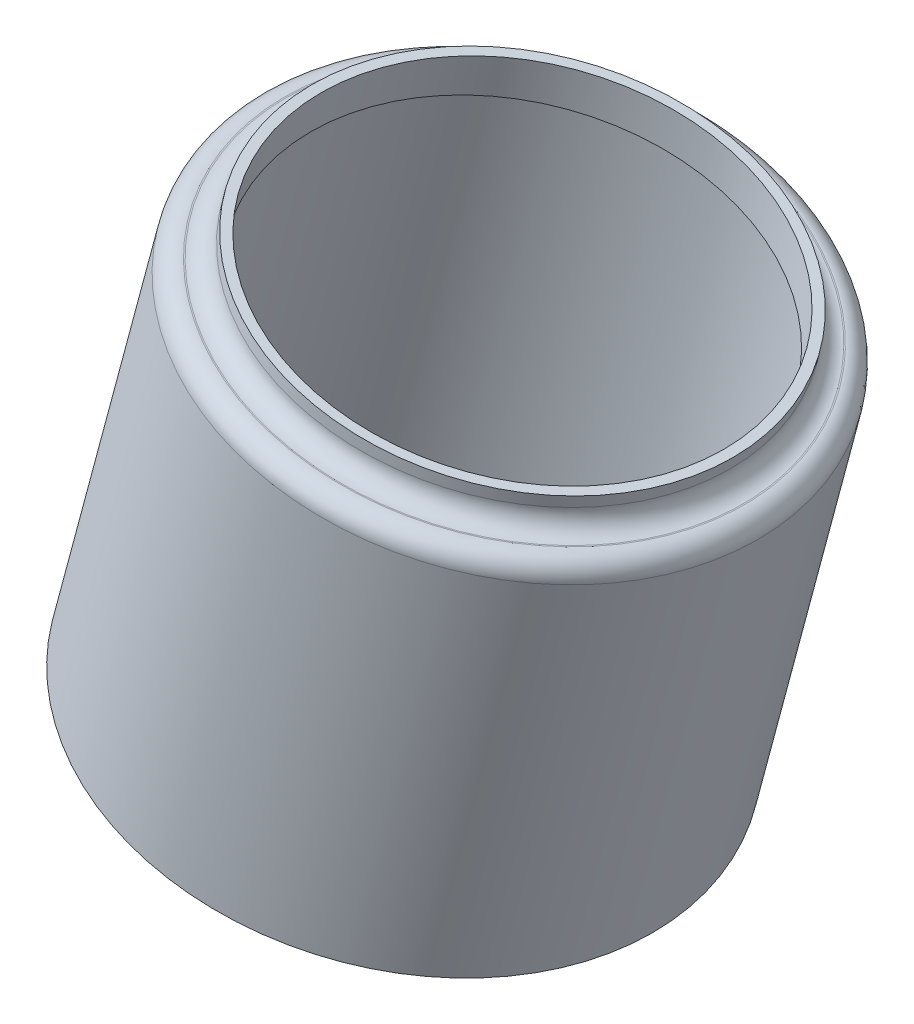
ISO-10303-21;
HEADER;
FILE_DESCRIPTION(('STEP AP214'),'2;1');
FILE_NAME('part.step','',(''),(''),'','','');
FILE_SCHEMA(('AUTOMOTIVE_DESIGN { 1 0 10303 214 1 1 1 1 }'));
ENDSEC;
DATA;
#1=APPLICATION_CONTEXT('core data for automotive mechanical design processes');
#2=APPLICATION_PROTOCOL_DEFINITION('international standard','automotive_design',2000,#1);
#3=PRODUCT_CONTEXT('',#1,'mechanical');
#4=PRODUCT('Part','Part','',(#3));
#5=PRODUCT_RELATED_PRODUCT_CATEGORY('part','',(#4));
#6=PRODUCT_DEFINITION_FORMATION('','',#4);
#7=PRODUCT_DEFINITION_CONTEXT('part definition',#1,'design');
#8=PRODUCT_DEFINITION('design','',#6,#7);
#9=PRODUCT_DEFINITION_SHAPE('','',#8);
#10=(LENGTH_UNIT() NAMED_UNIT(*) SI_UNIT(.MILLI.,.METRE.));
#11=(NAMED_UNIT(*) PLANE_ANGLE_UNIT() SI_UNIT($,.RADIAN.));
#12=(NAMED_UNIT(*) SI_UNIT($,.STERADIAN.) SOLID_ANGLE_UNIT());
#13=UNCERTAINTY_MEASURE_WITH_UNIT(LENGTH_MEASURE(1.E-05),#10,'distance_accuracy_value','');
#14=(GEOMETRIC_REPRESENTATION_CONTEXT(3) GLOBAL_UNCERTAINTY_ASSIGNED_CONTEXT((#13)) GLOBAL_UNIT_ASSIGNED_CONTEXT((#10,
#11,#12)) REPRESENTATION_CONTEXT('',''));
#15=CARTESIAN_POINT('',(0.,0.,0.));
#16=DIRECTION('',(0.,0.,1.));
#17=DIRECTION('',(1.,0.,0.));
#18=AXIS2_PLACEMENT_3D('',#15,#16,#17);
#19=CARTESIAN_POINT('',(114.170121613696,-21.7393802349997,0.));
#20=DIRECTION('',(0.258819045102515,0.965925826289077,0.));
#21=DIRECTION('',(-0.965925826289081,0.25881904510252,0.));
#22=AXIS2_PLACEMENT_3D('',#19,#20,#21);
#23=PLANE('',#22);
#24=CARTESIAN_POINT('',(107.791147456882,-20.0301392611427,0.));
#25=DIRECTION('',(0.258819045102515,0.965925826289077,0.));
#26=DIRECTION('',(-0.965925826289081,0.25881904510252,0.));
#27=AXIS2_PLACEMENT_3D('',#24,#25,#26);
#28=CIRCLE('',#27,6.8580000000005);
#29=CARTESIAN_POINT('',(101.166828140191,-18.2551582498295,0.));
#30=VERTEX_POINT('',#29);
#31=EDGE_CURVE('E10',#30,#30,#28,.T.);
#32=ORIENTED_EDGE('',*,*,#31,.F.);
#33=EDGE_LOOP('',(#32));
#34=FACE_BOUND('',#33,.T.);
#35=CARTESIAN_POINT('',(107.791147456882,-20.0301392611427,0.));
#36=DIRECTION('',(0.258819045102515,0.965925826289077,0.));
#37=DIRECTION('',(-0.965925826289081,0.25881904510252,0.));
#38=AXIS2_PLACEMENT_3D('',#35,#36,#37);
#39=CIRCLE('',#38,6.6040000000005);
#40=CARTESIAN_POINT('',(101.412173300069,-18.3208982872855,0.));
#41=VERTEX_POINT('',#40);
#42=EDGE_CURVE('E64',#41,#41,#39,.T.);
#43=ORIENTED_EDGE('',*,*,#42,.T.);
#44=EDGE_LOOP('',(#43));
#45=FACE_BOUND('',#44,.T.);
#46=ADVANCED_FACE('F30',(#34,#45),#23,.F.);
#47=CARTESIAN_POINT('',(111.078149329684,-7.76288126727148,0.));
#48=DIRECTION('',(0.258819045102515,0.965925826289077,0.));
#49=DIRECTION('',(-0.965925826289081,0.25881904510252,0.));
#50=AXIS2_PLACEMENT_3D('',#47,#48,#49);
#51=CYLINDRICAL_SURFACE('',#50,6.85800000000049);
#52=CARTESIAN_POINT('',(110.601534058128,-9.54163367638261,0.));
#53=DIRECTION('',(0.258819045102515,0.965925826289077,0.));
#54=DIRECTION('',(-0.965925826289081,0.25881904510252,0.));
#55=AXIS2_PLACEMENT_3D('',#52,#53,#54);
#56=CIRCLE('',#55,6.85800000000048);
#57=CARTESIAN_POINT('',(103.977214741437,-7.76665266506941,1.0573175668327E-13));
#58=VERTEX_POINT('',#57);
#59=EDGE_CURVE('E36',#58,#58,#56,.T.);
#60=ORIENTED_EDGE('',*,*,#59,.F.);
#61=EDGE_LOOP('',(#60));
#62=FACE_BOUND('',#61,.T.);
#63=ORIENTED_EDGE('',*,*,#31,.T.);
#64=EDGE_LOOP('',(#63));
#65=FACE_BOUND('',#64,.T.);
#66=ADVANCED_FACE('F113',(#62,#65),#51,.T.);
#67=CARTESIAN_POINT('',(110.601534058128,-9.54163367638261,0.));
#68=DIRECTION('',(0.258819045102515,0.965925826289077,0.));
#69=DIRECTION('',(-0.965925826289081,0.25881904510252,0.));
#70=AXIS2_PLACEMENT_3D('',#67,#68,#69);
#71=TOROIDAL_SURFACE('',#70,6.35000000000048,0.508000000000003);
#72=CARTESIAN_POINT('',(110.73301413304,-9.0509433566276,1.33573707650214E-13));
#73=DIRECTION('',(0.258819045102515,0.965925826289077,0.));
#74=DIRECTION('',(-0.965925826289081,0.25881904510252,0.));
#75=AXIS2_PLACEMENT_3D('',#72,#73,#74);
#76=CIRCLE('',#75,6.35000000000048);
#77=CARTESIAN_POINT('',(104.599385136104,-7.40744242022647,1.39918632235947E-13));
#78=VERTEX_POINT('',#77);
#79=EDGE_CURVE('E40',#78,#78,#76,.T.);
#80=ORIENTED_EDGE('',*,*,#79,.F.);
#81=EDGE_LOOP('',(#80));
#82=FACE_BOUND('',#81,.T.);
#83=ORIENTED_EDGE('',*,*,#59,.T.);
#84=EDGE_LOOP('',(#83));
#85=FACE_BOUND('',#84,.T.);
#86=ADVANCED_FACE('F108',(#82,#85),#71,.T.);
#87=CARTESIAN_POINT('',(116.866643129976,-10.6944442930291,0.));
#88=DIRECTION('',(-0.258819045102515,-0.965925826289077,0.));
#89=DIRECTION('',(0.965925826289081,-0.25881904510252,0.));
#90=AXIS2_PLACEMENT_3D('',#87,#88,#89);
#91=PLANE('',#90);
#92=CARTESIAN_POINT('',(110.73301413304,-9.0509433566276,1.33573707650214E-13));
#93=DIRECTION('',(0.258819045102515,0.965925826289077,0.));
#94=DIRECTION('',(-0.965925826289081,0.25881904510252,0.));
#95=AXIS2_PLACEMENT_3D('',#92,#93,#94);
#96=CIRCLE('',#95,6.31824999999999);
#97=CARTESIAN_POINT('',(104.630053281089,-7.4156599249086,1.39886907613018E-13));
#98=VERTEX_POINT('',#97);
#99=EDGE_CURVE('E44',#98,#98,#96,.T.);
#100=ORIENTED_EDGE('',*,*,#99,.F.);
#101=EDGE_LOOP('',(#100));
#102=FACE_BOUND('',#101,.T.);
#103=ORIENTED_EDGE('',*,*,#79,.T.);
#104=EDGE_LOOP('',(#103));
#105=FACE_BOUND('',#104,.T.);
#106=ADVANCED_FACE('F102',(#102,#105),#91,.F.);
#107=CARTESIAN_POINT('',(110.864494207952,-8.56025303687325,0.));
#108=DIRECTION('',(0.258819045102515,0.965925826289077,0.));
#109=DIRECTION('',(-0.965925826289081,0.25881904510252,0.));
#110=AXIS2_PLACEMENT_3D('',#107,#108,#109);
#111=TOROIDAL_SURFACE('',#110,6.31825,0.508000000000002);
#112=CARTESIAN_POINT('',(110.864494207952,-8.56025303687325,0.));
#113=DIRECTION('',(0.258819045102515,0.965925826289077,0.));
#114=DIRECTION('',(-0.965925826289081,0.25881904510252,0.));
#115=AXIS2_PLACEMENT_3D('',#112,#113,#114);
#116=CIRCLE('',#115,5.81024999999999);
#117=CARTESIAN_POINT('',(105.252223675756,-7.05644968006633,0.));
#118=VERTEX_POINT('',#117);
#119=EDGE_CURVE('E49',#118,#118,#116,.T.);
#120=ORIENTED_EDGE('',*,*,#119,.F.);
#121=EDGE_LOOP('',(#120));
#122=FACE_BOUND('',#121,.T.);
#123=ORIENTED_EDGE('',*,*,#99,.T.);
#124=EDGE_LOOP('',(#123));
#125=FACE_BOUND('',#124,.T.);
#126=ADVANCED_FACE('F96',(#122,#125),#111,.F.);
#127=CARTESIAN_POINT('',(111.078149329684,-7.76288126727148,0.));
#128=DIRECTION('',(0.258819045102515,0.965925826289077,0.));
#129=DIRECTION('',(-0.965925826289081,0.25881904510252,0.));
#130=AXIS2_PLACEMENT_3D('',#127,#128,#129);
#131=CYLINDRICAL_SURFACE('',#130,5.81025);
#132=CARTESIAN_POINT('',(110.946669254772,-8.25357158702639,0.));
#133=DIRECTION('',(0.258819045102515,0.965925826289077,0.));
#134=DIRECTION('',(-0.965925826289081,0.25881904510252,0.));
#135=AXIS2_PLACEMENT_3D('',#132,#133,#134);
#136=CIRCLE('',#135,5.81025);
#137=CARTESIAN_POINT('',(105.334398722576,-6.74976823021947,0.));
#138=VERTEX_POINT('',#137);
#139=EDGE_CURVE('E52',#138,#138,#136,.T.);
#140=ORIENTED_EDGE('',*,*,#139,.F.);
#141=EDGE_LOOP('',(#140));
#142=FACE_BOUND('',#141,.T.);
#143=ORIENTED_EDGE('',*,*,#119,.T.);
#144=EDGE_LOOP('',(#143));
#145=FACE_BOUND('',#144,.T.);
#146=ADVANCED_FACE('F90',(#142,#145),#131,.T.);
#147=CARTESIAN_POINT('',(116.313594627091,-9.69163490637692,0.));
#148=DIRECTION('',(-0.258819045102515,-0.965925826289077,0.));
#149=DIRECTION('',(0.965925826289081,-0.25881904510252,0.));
#150=AXIS2_PLACEMENT_3D('',#147,#148,#149);
#151=PLANE('',#150);
#152=CARTESIAN_POINT('',(110.946669254772,-8.25357158702639,0.));
#153=DIRECTION('',(0.258819045102515,0.965925826289077,0.));
#154=DIRECTION('',(-0.965925826289081,0.25881904510252,0.));
#155=AXIS2_PLACEMENT_3D('',#152,#153,#154);
#156=CIRCLE('',#155,5.55625);
#157=CARTESIAN_POINT('',(105.579743882453,-6.81550826767551,0.));
#158=VERTEX_POINT('',#157);
#159=EDGE_CURVE('E55',#158,#158,#156,.T.);
#160=ORIENTED_EDGE('',*,*,#159,.F.);
#161=EDGE_LOOP('',(#160));
#162=FACE_BOUND('',#161,.T.);
#163=ORIENTED_EDGE('',*,*,#139,.T.);
#164=EDGE_LOOP('',(#163));
#165=FACE_BOUND('',#164,.T.);
#166=ADVANCED_FACE('F84',(#162,#165),#151,.F.);
#167=CARTESIAN_POINT('',(111.078149329684,-7.76288126727148,0.));
#168=DIRECTION('',(0.258819045102515,0.965925826289077,0.));
#169=DIRECTION('',(-0.965925826289081,0.25881904510252,0.));
#170=AXIS2_PLACEMENT_3D('',#167,#168,#169);
#171=CYLINDRICAL_SURFACE('',#170,5.55625);
#172=CARTESIAN_POINT('',(110.667274095584,-9.29628851650521,0.));
#173=DIRECTION('',(0.258819045102515,0.965925826289077,0.));
#174=DIRECTION('',(-0.965925826289081,0.25881904510252,0.));
#175=AXIS2_PLACEMENT_3D('',#172,#173,#174);
#176=CIRCLE('',#175,5.55625);
#177=CARTESIAN_POINT('',(105.300348723265,-7.85822519715434,0.));
#178=VERTEX_POINT('',#177);
#179=EDGE_CURVE('E58',#178,#178,#176,.T.);
#180=ORIENTED_EDGE('',*,*,#179,.F.);
#181=EDGE_LOOP('',(#180));
#182=FACE_BOUND('',#181,.T.);
#183=ORIENTED_EDGE('',*,*,#159,.T.);
#184=EDGE_LOOP('',(#183));
#185=FACE_BOUND('',#184,.T.);
#186=ADVANCED_FACE('F78',(#182,#185),#171,.F.);
#187=CARTESIAN_POINT('',(117.046248252397,-11.0055294903627,0.));
#188=DIRECTION('',(0.258819045102515,0.965925826289077,0.));
#189=DIRECTION('',(-0.965925826289081,0.25881904510252,0.));
#190=AXIS2_PLACEMENT_3D('',#187,#188,#189);
#191=PLANE('',#190);
#192=CARTESIAN_POINT('',(110.667274095584,-9.29628851650521,0.));
#193=DIRECTION('',(0.258819045102515,0.965925826289077,0.));
#194=DIRECTION('',(-0.965925826289081,0.25881904510252,0.));
#195=AXIS2_PLACEMENT_3D('',#192,#193,#194);
#196=CIRCLE('',#195,6.60400000000048);
#197=CARTESIAN_POINT('',(104.28829993877,-7.58704754264805,0.));
#198=VERTEX_POINT('',#197);
#199=EDGE_CURVE('E61',#198,#198,#196,.T.);
#200=ORIENTED_EDGE('',*,*,#199,.F.);
#201=EDGE_LOOP('',(#200));
#202=FACE_BOUND('',#201,.T.);
#203=ORIENTED_EDGE('',*,*,#179,.T.);
#204=EDGE_LOOP('',(#203));
#205=FACE_BOUND('',#204,.T.);
#206=ADVANCED_FACE('F72',(#202,#205),#191,.F.);
#207=CARTESIAN_POINT('',(111.078149329684,-7.76288126727148,0.));
#208=DIRECTION('',(0.258819045102515,0.965925826289077,0.));
#209=DIRECTION('',(-0.965925826289081,0.25881904510252,0.));
#210=AXIS2_PLACEMENT_3D('',#207,#208,#209);
#211=CYLINDRICAL_SURFACE('',#210,6.60400000000049);
#212=ORIENTED_EDGE('',*,*,#42,.F.);
#213=EDGE_LOOP('',(#212));
#214=FACE_BOUND('',#213,.T.);
#215=ORIENTED_EDGE('',*,*,#199,.T.);
#216=EDGE_LOOP('',(#215));
#217=FACE_BOUND('',#216,.T.);
#218=ADVANCED_FACE('F69',(#214,#217),#211,.F.);
#219=CLOSED_SHELL('',(#46,#66,#86,#106,#126,#146,#166,#186,#206,#218));
#220=MANIFOLD_SOLID_BREP('B2',#219);
#221=ADVANCED_BREP_SHAPE_REPRESENTATION('',(#18,#220),#14);
#222=SHAPE_DEFINITION_REPRESENTATION(#9,#221);
ENDSEC;
END-ISO-10303-21;
